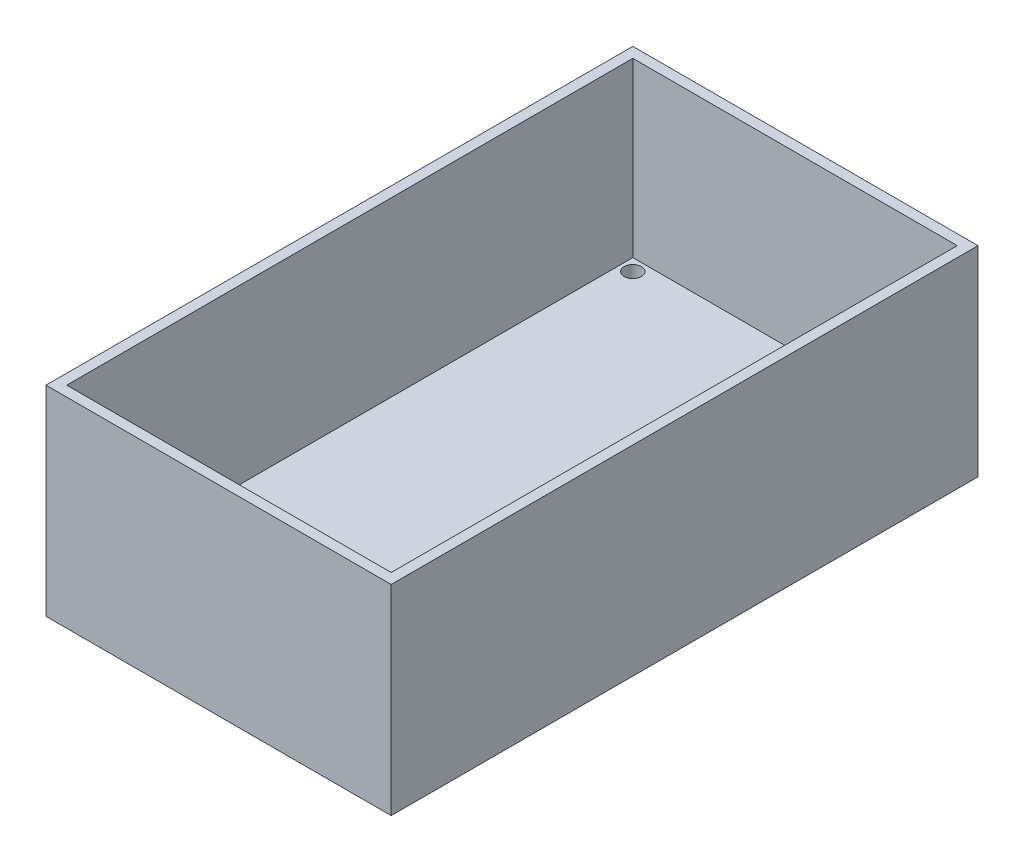
ISO-10303-21;
HEADER;
FILE_DESCRIPTION(('STEP AP214'),'2;1');
FILE_NAME('part.step','',(''),(''),'','','');
FILE_SCHEMA(('AUTOMOTIVE_DESIGN { 1 0 10303 214 1 1 1 1 }'));
ENDSEC;
DATA;
#1=APPLICATION_CONTEXT('core data for automotive mechanical design processes');
#2=APPLICATION_PROTOCOL_DEFINITION('international standard','automotive_design',2000,#1);
#3=PRODUCT_CONTEXT('',#1,'mechanical');
#4=PRODUCT('Part','Part','',(#3));
#5=PRODUCT_RELATED_PRODUCT_CATEGORY('part','',(#4));
#6=PRODUCT_DEFINITION_FORMATION('','',#4);
#7=PRODUCT_DEFINITION_CONTEXT('part definition',#1,'design');
#8=PRODUCT_DEFINITION('design','',#6,#7);
#9=PRODUCT_DEFINITION_SHAPE('','',#8);
#10=(LENGTH_UNIT() NAMED_UNIT(*) SI_UNIT(.MILLI.,.METRE.));
#11=(NAMED_UNIT(*) PLANE_ANGLE_UNIT() SI_UNIT($,.RADIAN.));
#12=(NAMED_UNIT(*) SI_UNIT($,.STERADIAN.) SOLID_ANGLE_UNIT());
#13=UNCERTAINTY_MEASURE_WITH_UNIT(LENGTH_MEASURE(1.E-05),#10,'distance_accuracy_value','');
#14=(GEOMETRIC_REPRESENTATION_CONTEXT(3) GLOBAL_UNCERTAINTY_ASSIGNED_CONTEXT((#13)) GLOBAL_UNIT_ASSIGNED_CONTEXT((#10,
#11,#12)) REPRESENTATION_CONTEXT('',''));
#15=CARTESIAN_POINT('',(0.,0.,0.));
#16=DIRECTION('',(0.,0.,1.));
#17=DIRECTION('',(1.,0.,0.));
#18=AXIS2_PLACEMENT_3D('',#15,#16,#17);
#19=CARTESIAN_POINT('',(0.,4.,-83.));
#20=DIRECTION('',(0.,0.,-1.));
#21=DIRECTION('',(-1.,0.,0.));
#22=AXIS2_PLACEMENT_3D('',#19,#20,#21);
#23=PLANE('',#22);
#24=DIRECTION('',(1.,0.,0.));
#25=VECTOR('',#24,1.);
#26=CARTESIAN_POINT('',(0.,0.,-83.));
#27=LINE('',#26,#25);
#28=CARTESIAN_POINT('',(-2.,0.,-83.));
#29=VERTEX_POINT('',#28);
#30=CARTESIAN_POINT('',(48.,0.,-83.));
#31=VERTEX_POINT('',#30);
#32=EDGE_CURVE('E170',#29,#31,#27,.T.);
#33=ORIENTED_EDGE('',*,*,#32,.F.);
#34=DIRECTION('',(0.,-1.,0.));
#35=VECTOR('',#34,1.);
#36=CARTESIAN_POINT('',(-2.,4.,-83.));
#37=LINE('',#36,#35);
#38=CARTESIAN_POINT('',(-2.,29.,-83.));
#39=VERTEX_POINT('',#38);
#40=EDGE_CURVE('E11',#39,#29,#37,.T.);
#41=ORIENTED_EDGE('',*,*,#40,.F.);
#42=DIRECTION('',(-1.,0.,0.));
#43=VECTOR('',#42,1.);
#44=CARTESIAN_POINT('',(-2.,29.,-83.));
#45=LINE('',#44,#43);
#46=CARTESIAN_POINT('',(48.,29.,-83.));
#47=VERTEX_POINT('',#46);
#48=EDGE_CURVE('E141',#47,#39,#45,.T.);
#49=ORIENTED_EDGE('',*,*,#48,.F.);
#50=DIRECTION('',(0.,-1.,0.));
#51=VECTOR('',#50,1.);
#52=CARTESIAN_POINT('',(48.,4.,-83.));
#53=LINE('',#52,#51);
#54=EDGE_CURVE('E158',#47,#31,#53,.T.);
#55=ORIENTED_EDGE('',*,*,#54,.T.);
#56=EDGE_LOOP('',(#33,#41,#49,#55));
#57=FACE_BOUND('',#56,.T.);
#58=ADVANCED_FACE('F33',(#57),#23,.T.);
#59=CARTESIAN_POINT('',(-2.,4.,0.));
#60=DIRECTION('',(-1.,0.,0.));
#61=DIRECTION('',(0.,0.,1.));
#62=AXIS2_PLACEMENT_3D('',#59,#60,#61);
#63=PLANE('',#62);
#64=DIRECTION('',(0.,0.,-1.));
#65=VECTOR('',#64,1.);
#66=CARTESIAN_POINT('',(-2.,0.,0.));
#67=LINE('',#66,#65);
#68=CARTESIAN_POINT('',(-2.,0.,2.));
#69=VERTEX_POINT('',#68);
#70=EDGE_CURVE('E173',#69,#29,#67,.T.);
#71=ORIENTED_EDGE('',*,*,#70,.F.);
#72=DIRECTION('',(0.,-1.,0.));
#73=VECTOR('',#72,1.);
#74=CARTESIAN_POINT('',(-2.,4.,2.));
#75=LINE('',#74,#73);
#76=CARTESIAN_POINT('',(-2.,29.,2.));
#77=VERTEX_POINT('',#76);
#78=EDGE_CURVE('E41',#77,#69,#75,.T.);
#79=ORIENTED_EDGE('',*,*,#78,.F.);
#80=DIRECTION('',(0.,0.,1.));
#81=VECTOR('',#80,1.);
#82=CARTESIAN_POINT('',(-2.,29.,-83.));
#83=LINE('',#82,#81);
#84=EDGE_CURVE('E111',#39,#77,#83,.T.);
#85=ORIENTED_EDGE('',*,*,#84,.F.);
#86=ORIENTED_EDGE('',*,*,#40,.T.);
#87=EDGE_LOOP('',(#71,#79,#85,#86));
#88=FACE_BOUND('',#87,.T.);
#89=ADVANCED_FACE('F193',(#88),#63,.T.);
#90=CARTESIAN_POINT('',(0.,4.,2.));
#91=DIRECTION('',(0.,0.,-1.));
#92=DIRECTION('',(-1.,0.,0.));
#93=AXIS2_PLACEMENT_3D('',#90,#91,#92);
#94=PLANE('',#93);
#95=DIRECTION('',(1.,0.,0.));
#96=VECTOR('',#95,1.);
#97=CARTESIAN_POINT('',(0.,0.,2.));
#98=LINE('',#97,#96);
#99=CARTESIAN_POINT('',(48.,0.,2.));
#100=VERTEX_POINT('',#99);
#101=EDGE_CURVE('E176',#69,#100,#98,.T.);
#102=ORIENTED_EDGE('',*,*,#101,.T.);
#103=DIRECTION('',(0.,-1.,0.));
#104=VECTOR('',#103,1.);
#105=CARTESIAN_POINT('',(48.,4.,2.));
#106=LINE('',#105,#104);
#107=CARTESIAN_POINT('',(48.,29.,2.));
#108=VERTEX_POINT('',#107);
#109=EDGE_CURVE('E182',#108,#100,#106,.T.);
#110=ORIENTED_EDGE('',*,*,#109,.F.);
#111=DIRECTION('',(1.,0.,0.));
#112=VECTOR('',#111,1.);
#113=CARTESIAN_POINT('',(-2.,29.,2.));
#114=LINE('',#113,#112);
#115=EDGE_CURVE('E135',#77,#108,#114,.T.);
#116=ORIENTED_EDGE('',*,*,#115,.F.);
#117=ORIENTED_EDGE('',*,*,#78,.T.);
#118=EDGE_LOOP('',(#102,#110,#116,#117));
#119=FACE_BOUND('',#118,.T.);
#120=ADVANCED_FACE('F187',(#119),#94,.F.);
#121=CARTESIAN_POINT('',(1.25000000000001,4.,-1.25));
#122=DIRECTION('',(0.,-1.,0.));
#123=DIRECTION('',(0.,0.,-1.));
#124=AXIS2_PLACEMENT_3D('',#121,#122,#123);
#125=CYLINDRICAL_SURFACE('',#124,1.25);
#126=CARTESIAN_POINT('',(1.25000000000001,4.,-1.25));
#127=DIRECTION('',(0.,1.,0.));
#128=DIRECTION('',(0.,0.,1.));
#129=AXIS2_PLACEMENT_3D('',#126,#127,#128);
#130=CIRCLE('',#129,1.25);
#131=CARTESIAN_POINT('',(1.25000000000001,4.,0.));
#132=VERTEX_POINT('',#131);
#133=EDGE_CURVE('E155',#132,#132,#130,.F.);
#134=ORIENTED_EDGE('',*,*,#133,.F.);
#135=EDGE_LOOP('',(#134));
#136=FACE_BOUND('',#135,.T.);
#137=CARTESIAN_POINT('',(1.25000000000001,0.,-1.25));
#138=DIRECTION('',(0.,1.,0.));
#139=DIRECTION('',(0.,0.,1.));
#140=AXIS2_PLACEMENT_3D('',#137,#138,#139);
#141=CIRCLE('',#140,1.25);
#142=CARTESIAN_POINT('',(1.25000000000001,0.,0.));
#143=VERTEX_POINT('',#142);
#144=EDGE_CURVE('E167',#143,#143,#141,.F.);
#145=ORIENTED_EDGE('',*,*,#144,.T.);
#146=EDGE_LOOP('',(#145));
#147=FACE_BOUND('',#146,.T.);
#148=ADVANCED_FACE('F220',(#136,#147),#125,.F.);
#149=CARTESIAN_POINT('',(1.25,4.,-79.75));
#150=DIRECTION('',(0.,-1.,0.));
#151=DIRECTION('',(0.,0.,-1.));
#152=AXIS2_PLACEMENT_3D('',#149,#150,#151);
#153=CYLINDRICAL_SURFACE('',#152,1.25);
#154=CARTESIAN_POINT('',(1.25,4.,-79.75));
#155=DIRECTION('',(0.,1.,0.));
#156=DIRECTION('',(0.,0.,1.));
#157=AXIS2_PLACEMENT_3D('',#154,#155,#156);
#158=CIRCLE('',#157,1.25);
#159=CARTESIAN_POINT('',(1.25,4.,-78.5));
#160=VERTEX_POINT('',#159);
#161=EDGE_CURVE('E152',#160,#160,#158,.T.);
#162=ORIENTED_EDGE('',*,*,#161,.T.);
#163=EDGE_LOOP('',(#162));
#164=FACE_BOUND('',#163,.T.);
#165=CARTESIAN_POINT('',(1.25,0.,-79.75));
#166=DIRECTION('',(0.,1.,0.));
#167=DIRECTION('',(0.,0.,1.));
#168=AXIS2_PLACEMENT_3D('',#165,#166,#167);
#169=CIRCLE('',#168,1.25);
#170=CARTESIAN_POINT('',(1.25,0.,-78.5));
#171=VERTEX_POINT('',#170);
#172=EDGE_CURVE('E164',#171,#171,#169,.T.);
#173=ORIENTED_EDGE('',*,*,#172,.F.);
#174=EDGE_LOOP('',(#173));
#175=FACE_BOUND('',#174,.T.);
#176=ADVANCED_FACE('F223',(#164,#175),#153,.F.);
#177=CARTESIAN_POINT('',(44.75,4.,-79.75));
#178=DIRECTION('',(0.,-1.,0.));
#179=DIRECTION('',(0.,0.,-1.));
#180=AXIS2_PLACEMENT_3D('',#177,#178,#179);
#181=CYLINDRICAL_SURFACE('',#180,1.25);
#182=CARTESIAN_POINT('',(44.75,4.,-79.75));
#183=DIRECTION('',(0.,1.,0.));
#184=DIRECTION('',(0.,0.,1.));
#185=AXIS2_PLACEMENT_3D('',#182,#183,#184);
#186=CIRCLE('',#185,1.25);
#187=CARTESIAN_POINT('',(44.75,4.,-78.5));
#188=VERTEX_POINT('',#187);
#189=EDGE_CURVE('E148',#188,#188,#186,.T.);
#190=ORIENTED_EDGE('',*,*,#189,.T.);
#191=EDGE_LOOP('',(#190));
#192=FACE_BOUND('',#191,.T.);
#193=CARTESIAN_POINT('',(44.75,0.,-79.75));
#194=DIRECTION('',(0.,1.,0.));
#195=DIRECTION('',(0.,0.,1.));
#196=AXIS2_PLACEMENT_3D('',#193,#194,#195);
#197=CIRCLE('',#196,1.25);
#198=CARTESIAN_POINT('',(44.75,0.,-78.5));
#199=VERTEX_POINT('',#198);
#200=EDGE_CURVE('E161',#199,#199,#197,.T.);
#201=ORIENTED_EDGE('',*,*,#200,.F.);
#202=EDGE_LOOP('',(#201));
#203=FACE_BOUND('',#202,.T.);
#204=ADVANCED_FACE('F226',(#192,#203),#181,.F.);
#205=CARTESIAN_POINT('',(44.75,4.,-1.25000000000002));
#206=DIRECTION('',(0.,-1.,0.));
#207=DIRECTION('',(0.,0.,-1.));
#208=AXIS2_PLACEMENT_3D('',#205,#206,#207);
#209=CYLINDRICAL_SURFACE('',#208,1.25);
#210=CARTESIAN_POINT('',(44.75,4.,-1.25000000000002));
#211=DIRECTION('',(0.,1.,0.));
#212=DIRECTION('',(0.,0.,1.));
#213=AXIS2_PLACEMENT_3D('',#210,#211,#212);
#214=CIRCLE('',#213,1.25);
#215=CARTESIAN_POINT('',(44.75,4.,0.));
#216=VERTEX_POINT('',#215);
#217=EDGE_CURVE('E145',#216,#216,#214,.F.);
#218=ORIENTED_EDGE('',*,*,#217,.F.);
#219=EDGE_LOOP('',(#218));
#220=FACE_BOUND('',#219,.T.);
#221=CARTESIAN_POINT('',(44.75,0.,-1.25000000000002));
#222=DIRECTION('',(0.,1.,0.));
#223=DIRECTION('',(0.,0.,1.));
#224=AXIS2_PLACEMENT_3D('',#221,#222,#223);
#225=CIRCLE('',#224,1.25);
#226=CARTESIAN_POINT('',(44.75,0.,0.));
#227=VERTEX_POINT('',#226);
#228=EDGE_CURVE('E144',#227,#227,#225,.F.);
#229=ORIENTED_EDGE('',*,*,#228,.T.);
#230=EDGE_LOOP('',(#229));
#231=FACE_BOUND('',#230,.T.);
#232=ADVANCED_FACE('F35',(#220,#231),#209,.F.);
#233=CARTESIAN_POINT('',(48.,4.,0.));
#234=DIRECTION('',(-1.,0.,0.));
#235=DIRECTION('',(0.,0.,1.));
#236=AXIS2_PLACEMENT_3D('',#233,#234,#235);
#237=PLANE('',#236);
#238=DIRECTION('',(0.,0.,-1.));
#239=VECTOR('',#238,1.);
#240=CARTESIAN_POINT('',(48.,0.,0.));
#241=LINE('',#240,#239);
#242=EDGE_CURVE('E149',#100,#31,#241,.T.);
#243=ORIENTED_EDGE('',*,*,#242,.T.);
#244=ORIENTED_EDGE('',*,*,#54,.F.);
#245=DIRECTION('',(0.,0.,-1.));
#246=VECTOR('',#245,1.);
#247=CARTESIAN_POINT('',(48.,29.,-83.));
#248=LINE('',#247,#246);
#249=EDGE_CURVE('E138',#108,#47,#248,.T.);
#250=ORIENTED_EDGE('',*,*,#249,.F.);
#251=ORIENTED_EDGE('',*,*,#109,.T.);
#252=EDGE_LOOP('',(#243,#244,#250,#251));
#253=FACE_BOUND('',#252,.T.);
#254=ADVANCED_FACE('F199',(#253),#237,.F.);
#255=CARTESIAN_POINT('',(0.,4.,0.));
#256=DIRECTION('',(0.,1.,0.));
#257=DIRECTION('',(0.,0.,1.));
#258=AXIS2_PLACEMENT_3D('',#255,#256,#257);
#259=PLANE('',#258);
#260=DIRECTION('',(-1.,0.,0.));
#261=VECTOR('',#260,1.);
#262=CARTESIAN_POINT('',(-0.5,4.,-81.5));
#263=LINE('',#262,#261);
#264=CARTESIAN_POINT('',(46.5,4.,-81.5));
#265=VERTEX_POINT('',#264);
#266=CARTESIAN_POINT('',(-0.5,4.,-81.5));
#267=VERTEX_POINT('',#266);
#268=EDGE_CURVE('E48',#265,#267,#263,.T.);
#269=ORIENTED_EDGE('',*,*,#268,.T.);
#270=DIRECTION('',(0.,0.,1.));
#271=VECTOR('',#270,1.);
#272=CARTESIAN_POINT('',(-0.5,4.,-81.5));
#273=LINE('',#272,#271);
#274=CARTESIAN_POINT('',(-0.49999999999999,4.,0.5));
#275=VERTEX_POINT('',#274);
#276=EDGE_CURVE('E52',#267,#275,#273,.T.);
#277=ORIENTED_EDGE('',*,*,#276,.T.);
#278=DIRECTION('',(1.,0.,0.));
#279=VECTOR('',#278,1.);
#280=CARTESIAN_POINT('',(-0.49999999999999,4.,0.5));
#281=LINE('',#280,#279);
#282=CARTESIAN_POINT('',(46.5,4.,0.5));
#283=VERTEX_POINT('',#282);
#284=EDGE_CURVE('E125',#275,#283,#281,.T.);
#285=ORIENTED_EDGE('',*,*,#284,.T.);
#286=DIRECTION('',(0.,0.,-1.));
#287=VECTOR('',#286,1.);
#288=CARTESIAN_POINT('',(46.5,4.,-81.5));
#289=LINE('',#288,#287);
#290=EDGE_CURVE('E106',#283,#265,#289,.T.);
#291=ORIENTED_EDGE('',*,*,#290,.T.);
#292=EDGE_LOOP('',(#269,#277,#285,#291));
#293=FACE_BOUND('',#292,.T.);
#294=ORIENTED_EDGE('',*,*,#217,.T.);
#295=EDGE_LOOP('',(#294));
#296=FACE_BOUND('',#295,.T.);
#297=ORIENTED_EDGE('',*,*,#189,.F.);
#298=EDGE_LOOP('',(#297));
#299=FACE_BOUND('',#298,.T.);
#300=ORIENTED_EDGE('',*,*,#161,.F.);
#301=EDGE_LOOP('',(#300));
#302=FACE_BOUND('',#301,.T.);
#303=ORIENTED_EDGE('',*,*,#133,.T.);
#304=EDGE_LOOP('',(#303));
#305=FACE_BOUND('',#304,.T.);
#306=ADVANCED_FACE('F208',(#293,#296,#299,#302,#305),#259,.T.);
#307=CARTESIAN_POINT('',(0.,0.,0.));
#308=DIRECTION('',(0.,1.,0.));
#309=DIRECTION('',(0.,0.,1.));
#310=AXIS2_PLACEMENT_3D('',#307,#308,#309);
#311=PLANE('',#310);
#312=ORIENTED_EDGE('',*,*,#228,.F.);
#313=EDGE_LOOP('',(#312));
#314=FACE_BOUND('',#313,.T.);
#315=ORIENTED_EDGE('',*,*,#200,.T.);
#316=EDGE_LOOP('',(#315));
#317=FACE_BOUND('',#316,.T.);
#318=ORIENTED_EDGE('',*,*,#172,.T.);
#319=EDGE_LOOP('',(#318));
#320=FACE_BOUND('',#319,.T.);
#321=ORIENTED_EDGE('',*,*,#144,.F.);
#322=EDGE_LOOP('',(#321));
#323=FACE_BOUND('',#322,.T.);
#324=ORIENTED_EDGE('',*,*,#32,.T.);
#325=ORIENTED_EDGE('',*,*,#242,.F.);
#326=ORIENTED_EDGE('',*,*,#101,.F.);
#327=ORIENTED_EDGE('',*,*,#70,.T.);
#328=EDGE_LOOP('',(#324,#325,#326,#327));
#329=FACE_BOUND('',#328,.T.);
#330=ADVANCED_FACE('F192',(#314,#317,#320,#323,#329),#311,.F.);
#331=CARTESIAN_POINT('',(0.,29.,0.));
#332=DIRECTION('',(0.,1.,0.));
#333=DIRECTION('',(0.,0.,1.));
#334=AXIS2_PLACEMENT_3D('',#331,#332,#333);
#335=PLANE('',#334);
#336=ORIENTED_EDGE('',*,*,#84,.T.);
#337=ORIENTED_EDGE('',*,*,#115,.T.);
#338=ORIENTED_EDGE('',*,*,#249,.T.);
#339=ORIENTED_EDGE('',*,*,#48,.T.);
#340=EDGE_LOOP('',(#336,#337,#338,#339));
#341=FACE_BOUND('',#340,.T.);
#342=DIRECTION('',(0.,0.,1.));
#343=VECTOR('',#342,1.);
#344=CARTESIAN_POINT('',(-0.5,29.,-81.5));
#345=LINE('',#344,#343);
#346=CARTESIAN_POINT('',(-0.5,29.,-81.5));
#347=VERTEX_POINT('',#346);
#348=CARTESIAN_POINT('',(-0.49999999999999,29.,0.5));
#349=VERTEX_POINT('',#348);
#350=EDGE_CURVE('E105',#347,#349,#345,.T.);
#351=ORIENTED_EDGE('',*,*,#350,.F.);
#352=DIRECTION('',(-1.,0.,0.));
#353=VECTOR('',#352,1.);
#354=CARTESIAN_POINT('',(-0.5,29.,-81.5));
#355=LINE('',#354,#353);
#356=CARTESIAN_POINT('',(46.5,29.,-81.5));
#357=VERTEX_POINT('',#356);
#358=EDGE_CURVE('E96',#357,#347,#355,.T.);
#359=ORIENTED_EDGE('',*,*,#358,.F.);
#360=DIRECTION('',(0.,0.,-1.));
#361=VECTOR('',#360,1.);
#362=CARTESIAN_POINT('',(46.5,29.,-81.5));
#363=LINE('',#362,#361);
#364=CARTESIAN_POINT('',(46.5,29.,0.5));
#365=VERTEX_POINT('',#364);
#366=EDGE_CURVE('E119',#365,#357,#363,.T.);
#367=ORIENTED_EDGE('',*,*,#366,.F.);
#368=DIRECTION('',(1.,0.,0.));
#369=VECTOR('',#368,1.);
#370=CARTESIAN_POINT('',(-0.49999999999999,29.,0.5));
#371=LINE('',#370,#369);
#372=EDGE_CURVE('E117',#349,#365,#371,.T.);
#373=ORIENTED_EDGE('',*,*,#372,.F.);
#374=EDGE_LOOP('',(#351,#359,#367,#373));
#375=FACE_BOUND('',#374,.T.);
#376=ADVANCED_FACE('F115',(#341,#375),#335,.T.);
#377=CARTESIAN_POINT('',(-0.5,29.,-81.5));
#378=DIRECTION('',(0.,0.,1.));
#379=DIRECTION('',(1.,0.,0.));
#380=AXIS2_PLACEMENT_3D('',#377,#378,#379);
#381=PLANE('',#380);
#382=ORIENTED_EDGE('',*,*,#268,.F.);
#383=DIRECTION('',(0.,-1.,0.));
#384=VECTOR('',#383,1.);
#385=CARTESIAN_POINT('',(46.5,29.,-81.5));
#386=LINE('',#385,#384);
#387=EDGE_CURVE('E101',#357,#265,#386,.T.);
#388=ORIENTED_EDGE('',*,*,#387,.F.);
#389=ORIENTED_EDGE('',*,*,#358,.T.);
#390=DIRECTION('',(0.,-1.,0.));
#391=VECTOR('',#390,1.);
#392=CARTESIAN_POINT('',(-0.5,29.,-81.5));
#393=LINE('',#392,#391);
#394=EDGE_CURVE('E99',#347,#267,#393,.T.);
#395=ORIENTED_EDGE('',*,*,#394,.T.);
#396=EDGE_LOOP('',(#382,#388,#389,#395));
#397=FACE_BOUND('',#396,.T.);
#398=ADVANCED_FACE('F98',(#397),#381,.T.);
#399=CARTESIAN_POINT('',(-0.5,29.,-81.5));
#400=DIRECTION('',(1.,0.,0.));
#401=DIRECTION('',(0.,0.,-1.));
#402=AXIS2_PLACEMENT_3D('',#399,#400,#401);
#403=PLANE('',#402);
#404=ORIENTED_EDGE('',*,*,#276,.F.);
#405=ORIENTED_EDGE('',*,*,#394,.F.);
#406=ORIENTED_EDGE('',*,*,#350,.T.);
#407=DIRECTION('',(0.,-1.,0.));
#408=VECTOR('',#407,1.);
#409=CARTESIAN_POINT('',(-0.49999999999999,29.,0.5));
#410=LINE('',#409,#408);
#411=EDGE_CURVE('E112',#349,#275,#410,.T.);
#412=ORIENTED_EDGE('',*,*,#411,.T.);
#413=EDGE_LOOP('',(#404,#405,#406,#412));
#414=FACE_BOUND('',#413,.T.);
#415=ADVANCED_FACE('F109',(#414),#403,.T.);
#416=CARTESIAN_POINT('',(-0.49999999999999,29.,0.5));
#417=DIRECTION('',(0.,0.,-1.));
#418=DIRECTION('',(-1.,0.,0.));
#419=AXIS2_PLACEMENT_3D('',#416,#417,#418);
#420=PLANE('',#419);
#421=ORIENTED_EDGE('',*,*,#284,.F.);
#422=ORIENTED_EDGE('',*,*,#411,.F.);
#423=ORIENTED_EDGE('',*,*,#372,.T.);
#424=DIRECTION('',(0.,-1.,0.));
#425=VECTOR('',#424,1.);
#426=CARTESIAN_POINT('',(46.5,29.,0.5));
#427=LINE('',#426,#425);
#428=EDGE_CURVE('E129',#365,#283,#427,.T.);
#429=ORIENTED_EDGE('',*,*,#428,.T.);
#430=EDGE_LOOP('',(#421,#422,#423,#429));
#431=FACE_BOUND('',#430,.T.);
#432=ADVANCED_FACE('F330',(#431),#420,.T.);
#433=CARTESIAN_POINT('',(46.5,29.,-81.5));
#434=DIRECTION('',(-1.,0.,0.));
#435=DIRECTION('',(0.,0.,1.));
#436=AXIS2_PLACEMENT_3D('',#433,#434,#435);
#437=PLANE('',#436);
#438=ORIENTED_EDGE('',*,*,#290,.F.);
#439=ORIENTED_EDGE('',*,*,#428,.F.);
#440=ORIENTED_EDGE('',*,*,#366,.T.);
#441=ORIENTED_EDGE('',*,*,#387,.T.);
#442=EDGE_LOOP('',(#438,#439,#440,#441));
#443=FACE_BOUND('',#442,.T.);
#444=ADVANCED_FACE('F338',(#443),#437,.T.);
#445=CLOSED_SHELL('',(#58,#89,#120,#148,#176,#204,#232,#254,#306,#330,#376,#398,#415,#432,#444));
#446=MANIFOLD_SOLID_BREP('B2',#445);
#447=ADVANCED_BREP_SHAPE_REPRESENTATION('',(#18,#446),#14);
#448=SHAPE_DEFINITION_REPRESENTATION(#9,#447);
ENDSEC;
END-ISO-10303-21;
